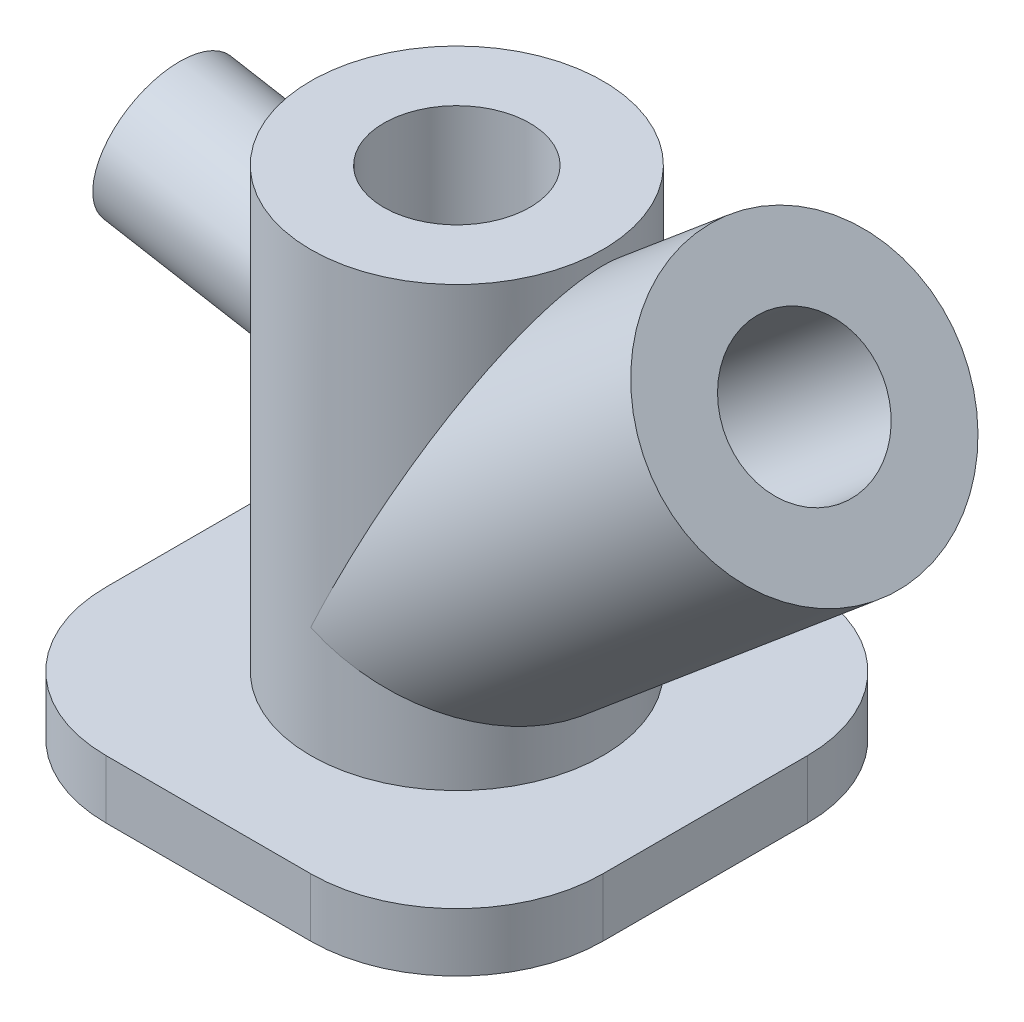
ISO-10303-21;
HEADER;
FILE_DESCRIPTION(('STEP AP214'),'2;1');
FILE_NAME('part.step','',(''),(''),'','','');
FILE_SCHEMA(('AUTOMOTIVE_DESIGN { 1 0 10303 214 1 1 1 1 }'));
ENDSEC;
DATA;
#1=APPLICATION_CONTEXT('core data for automotive mechanical design processes');
#2=APPLICATION_PROTOCOL_DEFINITION('international standard','automotive_design',2000,#1);
#3=PRODUCT_CONTEXT('',#1,'mechanical');
#4=PRODUCT('Part','Part','',(#3));
#5=PRODUCT_RELATED_PRODUCT_CATEGORY('part','',(#4));
#6=PRODUCT_DEFINITION_FORMATION('','',#4);
#7=PRODUCT_DEFINITION_CONTEXT('part definition',#1,'design');
#8=PRODUCT_DEFINITION('design','',#6,#7);
#9=PRODUCT_DEFINITION_SHAPE('','',#8);
#10=(LENGTH_UNIT() NAMED_UNIT(*) SI_UNIT(.MILLI.,.METRE.));
#11=(NAMED_UNIT(*) PLANE_ANGLE_UNIT() SI_UNIT($,.RADIAN.));
#12=(NAMED_UNIT(*) SI_UNIT($,.STERADIAN.) SOLID_ANGLE_UNIT());
#13=UNCERTAINTY_MEASURE_WITH_UNIT(LENGTH_MEASURE(1.E-05),#10,'distance_accuracy_value','');
#14=(GEOMETRIC_REPRESENTATION_CONTEXT(3) GLOBAL_UNCERTAINTY_ASSIGNED_CONTEXT((#13)) GLOBAL_UNIT_ASSIGNED_CONTEXT((#10,
#11,#12)) REPRESENTATION_CONTEXT('',''));
#15=CARTESIAN_POINT('',(0.,0.,0.));
#16=DIRECTION('',(0.,0.,1.));
#17=DIRECTION('',(1.,0.,0.));
#18=AXIS2_PLACEMENT_3D('',#15,#16,#17);
#19=CARTESIAN_POINT('',(0.,170.,0.));
#20=DIRECTION('',(0.,-1.,0.));
#21=DIRECTION('',(0.,0.,-1.));
#22=AXIS2_PLACEMENT_3D('',#19,#20,#21);
#23=CYLINDRICAL_SURFACE('',#22,50.);
#24=CARTESIAN_POINT('',(0.,58.0450184411362,0.));
#25=DIRECTION('',(0.4226182617407,0.90630778703665,0.));
#26=DIRECTION('',(0.906307787036649,-0.4226182617407,0.));
#27=AXIS2_PLACEMENT_3D('',#24,#25,#26);
#28=ELLIPSE('',#27,55.1688959481246,50.);
#29=CARTESIAN_POINT('',(0.,58.0450184411363,50.));
#30=VERTEX_POINT('',#29);
#31=CARTESIAN_POINT('',(0.,58.0450184411362,-50.));
#32=VERTEX_POINT('',#31);
#33=EDGE_CURVE('E138',#30,#32,#28,.T.);
#34=ORIENTED_EDGE('',*,*,#33,.F.);
#35=CARTESIAN_POINT('',(0.,58.0450184411362,0.));
#36=DIRECTION('',(0.906307787036649,-0.4226182617407,0.));
#37=DIRECTION('',(0.4226182617407,0.90630778703665,0.));
#38=AXIS2_PLACEMENT_3D('',#35,#36,#37);
#39=ELLIPSE('',#38,118.310079157625,50.);
#40=EDGE_CURVE('E66',#32,#30,#39,.T.);
#41=ORIENTED_EDGE('',*,*,#40,.F.);
#42=EDGE_LOOP('',(#34,#41));
#43=FACE_BOUND('',#42,.T.);
#44=CARTESIAN_POINT('',(0.,170.,0.));
#45=DIRECTION('',(0.,1.,0.));
#46=DIRECTION('',(0.,0.,1.));
#47=AXIS2_PLACEMENT_3D('',#44,#45,#46);
#48=CIRCLE('',#47,50.);
#49=CARTESIAN_POINT('',(0.,170.,50.));
#50=VERTEX_POINT('',#49);
#51=EDGE_CURVE('E148',#50,#50,#48,.T.);
#52=ORIENTED_EDGE('',*,*,#51,.F.);
#53=EDGE_LOOP('',(#52));
#54=FACE_BOUND('',#53,.T.);
#55=CARTESIAN_POINT('',(0.,20.,0.));
#56=DIRECTION('',(0.,1.,0.));
#57=DIRECTION('',(0.,0.,1.));
#58=AXIS2_PLACEMENT_3D('',#55,#56,#57);
#59=CIRCLE('',#58,50.);
#60=CARTESIAN_POINT('',(0.,20.,50.));
#61=VERTEX_POINT('',#60);
#62=EDGE_CURVE('E53',#61,#61,#59,.T.);
#63=ORIENTED_EDGE('',*,*,#62,.T.);
#64=EDGE_LOOP('',(#63));
#65=FACE_BOUND('',#64,.T.);
#66=CARTESIAN_POINT('',(-50.,94.6143347028564,0.));
#67=CARTESIAN_POINT('',(-49.9999974205173,94.6143370104762,0.683769614526524));
#68=CARTESIAN_POINT('',(-49.9859427588464,94.6403675697217,1.36758993254433));
#69=CARTESIAN_POINT('',(-49.9300637493252,94.7442856080541,2.73017085681891));
#70=CARTESIAN_POINT('',(-49.8882366224137,94.822178276743,3.40893094984836));
#71=CARTESIAN_POINT('',(-49.7778183945704,95.0292441660021,4.75669686962623));
#72=CARTESIAN_POINT('',(-49.7092148092875,95.1584413074419,5.42569799516341));
#73=CARTESIAN_POINT('',(-49.546919608656,95.4671224990813,6.74885663348031));
#74=CARTESIAN_POINT('',(-49.4532284701332,95.6466055935255,7.40301442812307));
#75=CARTESIAN_POINT('',(-49.2432278593259,96.0541614551474,8.69075795848963));
#76=CARTESIAN_POINT('',(-49.1269649270853,96.2821343337184,9.32438294567188));
#77=CARTESIAN_POINT('',(-48.8744476066246,96.7854075315033,10.5684082460756));
#78=CARTESIAN_POINT('',(-48.7381931369131,97.0607080436393,11.1788084646134));
#79=CARTESIAN_POINT('',(-48.4488595648421,97.657071754603,12.3727687048263));
#80=CARTESIAN_POINT('',(-48.2957780155802,97.9781416109803,12.9563248054284));
#81=CARTESIAN_POINT('',(-47.9763751175476,98.6643405241817,14.0931212353726));
#82=CARTESIAN_POINT('',(-47.8100534259139,99.0294707221063,14.6463607790188));
#83=CARTESIAN_POINT('',(-47.4624082629497,99.8148828506549,15.7371609255191));
#84=CARTESIAN_POINT('',(-47.2807703500464,100.236591089658,16.2735950247523));
#85=CARTESIAN_POINT('',(-46.9121760332906,101.12327596379,17.3074837492921));
#86=CARTESIAN_POINT('',(-46.72521949536,101.58825369038,17.8049373907448));
#87=CARTESIAN_POINT('',(-46.3508971465122,102.559568713954,18.7578375436637));
#88=CARTESIAN_POINT('',(-46.1635312394434,103.065917047869,19.2132727759241));
#89=CARTESIAN_POINT('',(-45.7936677202241,104.11761503323,20.0788836868117));
#90=CARTESIAN_POINT('',(-45.6111700862474,104.662964509778,20.4890595683796));
#91=CARTESIAN_POINT('',(-45.254683525863,105.795683739431,21.2649422351968));
#92=CARTESIAN_POINT('',(-45.0807976063329,106.383418315255,21.6301647416043));
#93=CARTESIAN_POINT('',(-44.7491355732758,107.592749774355,22.3082365146783));
#94=CARTESIAN_POINT('',(-44.5913596525385,108.214347062733,22.6210851546112));
#95=CARTESIAN_POINT('',(-44.2974983338386,109.4867496267,23.191259532847));
#96=CARTESIAN_POINT('',(-44.1613929028109,110.137527205017,23.4486366300341));
#97=CARTESIAN_POINT('',(-43.9156256881849,111.463838746237,23.9057591136535));
#98=CARTESIAN_POINT('',(-43.805960913154,112.139369898608,24.1055110201656));
#99=CARTESIAN_POINT('',(-43.6252945938812,113.449660711355,24.4308243693494));
#100=CARTESIAN_POINT('',(-43.5517576651517,114.082847581072,24.5613319565266));
#101=CARTESIAN_POINT('',(-43.4321635502894,115.360053053188,24.7722007574968));
#102=CARTESIAN_POINT('',(-43.3861046089863,116.004070961046,24.852565174225));
#103=CARTESIAN_POINT('',(-43.3225490654324,117.297721291582,24.9631891407469));
#104=CARTESIAN_POINT('',(-43.3050503381485,117.947353292926,24.9934524183365));
#105=CARTESIAN_POINT('',(-43.2985906455382,119.247157996945,25.0046412301015));
#106=CARTESIAN_POINT('',(-43.3096297605102,119.897330701137,24.9855666254522));
#107=CARTESIAN_POINT('',(-43.3580038594837,121.16213983119,24.9015188594484));
#108=CARTESIAN_POINT('',(-43.3940465118058,121.776979367414,24.8388009699454));
#109=CARTESIAN_POINT('',(-43.4894156314031,122.999033054608,24.6714404556483));
#110=CARTESIAN_POINT('',(-43.5487410998839,123.606247531528,24.5667996292749));
#111=CARTESIAN_POINT('',(-43.6885571195765,124.80997385746,24.3172857103871));
#112=CARTESIAN_POINT('',(-43.7690524287219,125.406483268266,24.1724035732042));
#113=CARTESIAN_POINT('',(-43.9487210064401,126.585941260491,23.8441792245356));
#114=CARTESIAN_POINT('',(-44.0478955749679,127.168888894924,23.6608343361912));
#115=CARTESIAN_POINT('',(-44.2742247437396,128.383141111034,23.2348340452958));
#116=CARTESIAN_POINT('',(-44.4032673899926,129.01257285307,22.9878410223019));
#117=CARTESIAN_POINT('',(-44.6773413453455,130.249081383441,22.4505254463652));
#118=CARTESIAN_POINT('',(-44.8223744792677,130.856155609786,22.1601979467844));
#119=CARTESIAN_POINT('',(-45.1247443633925,132.045995450437,21.5378090093763));
#120=CARTESIAN_POINT('',(-45.2820913542813,132.62874020039,21.2057126925898));
#121=CARTESIAN_POINT('',(-45.6052246231058,133.767111846372,20.5015503970951));
#122=CARTESIAN_POINT('',(-45.771011379658,134.322737200961,20.1294821502592));
#123=CARTESIAN_POINT('',(-46.133416664014,135.488471974528,19.2860027381762));
#124=CARTESIAN_POINT('',(-46.330831301436,136.093678737944,18.8081321953635));
#125=CARTESIAN_POINT('',(-46.7264162299674,137.261112698596,17.802640562321));
#126=CARTESIAN_POINT('',(-46.9245866297953,137.82333344692,17.2750120336388));
#127=CARTESIAN_POINT('',(-47.3160569814938,138.900309311597,16.1719772483777));
#128=CARTESIAN_POINT('',(-47.5093593139214,139.415087968771,15.5965949595944));
#129=CARTESIAN_POINT('',(-47.7914820898759,140.147997012276,14.6994077206121));
#130=CARTESIAN_POINT('',(-47.8842133784383,140.38574577822,14.3946760360086));
#131=CARTESIAN_POINT('',(-48.0664308108083,140.847640027826,13.7739923683567));
#132=CARTESIAN_POINT('',(-48.15591611277,141.071781992577,13.4580375160438));
#133=CARTESIAN_POINT('',(-48.3873437669983,141.645590870041,12.6081273764939));
#134=CARTESIAN_POINT('',(-48.525921944224,141.983048446905,12.0649191871289));
#135=CARTESIAN_POINT('',(-48.789282230443,142.615784704089,10.9514019016651));
#136=CARTESIAN_POINT('',(-48.9140668911132,142.911071188644,10.3810978460628));
#137=CARTESIAN_POINT('',(-49.1468690288969,143.456060360044,9.21616846202362));
#138=CARTESIAN_POINT('',(-49.2548965922981,143.705790483841,8.62155803836257));
#139=CARTESIAN_POINT('',(-49.4515239689308,144.156590753829,7.4109882344763));
#140=CARTESIAN_POINT('',(-49.540123565777,144.357660358049,6.79502861655599));
#141=CARTESIAN_POINT('',(-49.6959565722886,144.709220411247,5.54192453561224));
#142=CARTESIAN_POINT('',(-49.7630530183557,144.859386971255,4.9046717498291));
#143=CARTESIAN_POINT('',(-49.8731403270547,145.104865157284,3.61759177796644));
#144=CARTESIAN_POINT('',(-49.9161311202256,145.20017662524,2.96776455565899));
#145=CARTESIAN_POINT('',(-49.9766687089407,145.334192290471,1.66133280272256));
#146=CARTESIAN_POINT('',(-49.9942243693058,145.372916210055,1.00473071370772));
#147=CARTESIAN_POINT('',(-50.0033588952063,145.393080035525,-0.309503214050405));
#148=CARTESIAN_POINT('',(-49.9949399983561,145.374524875798,-0.967134959214428));
#149=CARTESIAN_POINT('',(-49.9546136155968,145.285384108985,-2.20954329617796));
#150=CARTESIAN_POINT('',(-49.925228449484,145.220384780121,-2.79481300750862));
#151=CARTESIAN_POINT('',(-49.8465610700055,145.045643014698,-3.95722491357461));
#152=CARTESIAN_POINT('',(-49.797280474891,144.935904217143,-4.53436776538092));
#153=CARTESIAN_POINT('',(-49.6800134980864,144.673218422081,-5.67680180250475));
#154=CARTESIAN_POINT('',(-49.6120257775175,144.5202683319,-6.24209213641366));
#155=CARTESIAN_POINT('',(-49.4589170743074,144.173149350376,-7.35747706474402));
#156=CARTESIAN_POINT('',(-49.3737953033583,143.978978562519,-7.90757095867877));
#157=CARTESIAN_POINT('',(-49.1860476217651,143.546575413149,-9.00270808762284));
#158=CARTESIAN_POINT('',(-49.0830508403701,143.307397930076,-9.5473137178049));
#159=CARTESIAN_POINT('',(-48.8632382420039,142.7908284834,-10.6151378938692));
#160=CARTESIAN_POINT('',(-48.746422374353,142.51343637965,-11.1383563613075));
#161=CARTESIAN_POINT('',(-48.5012932530952,141.923053175882,-12.1614677869305));
#162=CARTESIAN_POINT('',(-48.3729797160672,141.610061198264,-12.6613601696577));
#163=CARTESIAN_POINT('',(-48.1071945075437,140.950892991603,-13.6364720960583));
#164=CARTESIAN_POINT('',(-47.9697189170962,140.604702534182,-14.111680924998));
#165=CARTESIAN_POINT('',(-47.6674656612901,139.828731746769,-15.103621725449));
#166=CARTESIAN_POINT('',(-47.5016350555802,139.394130422369,-15.6162658548168));
#167=CARTESIAN_POINT('',(-47.1648021478064,138.487852960488,-16.6058642305704));
#168=CARTESIAN_POINT('',(-46.9937992280826,138.016172384293,-17.0828141906665));
#169=CARTESIAN_POINT('',(-46.6501084703486,137.038231904862,-18.0002094986339));
#170=CARTESIAN_POINT('',(-46.4774191597101,136.531938924525,-18.4406190116629));
#171=CARTESIAN_POINT('',(-46.1341862850847,135.487830816505,-19.2832532305185));
#172=CARTESIAN_POINT('',(-45.9636428306511,134.950014087294,-19.6854759935875));
#173=CARTESIAN_POINT('',(-45.6030902043994,133.761835979311,-20.5082719648703));
#174=CARTESIAN_POINT('',(-45.4140290541734,133.106741224471,-20.9224489244334));
#175=CARTESIAN_POINT('',(-45.0494075633064,131.761438851418,-21.6964041266871));
#176=CARTESIAN_POINT('',(-44.87384926778,131.071225940482,-22.0561741369552));
#177=CARTESIAN_POINT('',(-44.5422433084101,129.659783182607,-22.7183988750293));
#178=CARTESIAN_POINT('',(-44.3861842676647,128.938571755135,-23.0208870777112));
#179=CARTESIAN_POINT('',(-44.0994121945741,127.468904015715,-23.5655832613849));
#180=CARTESIAN_POINT('',(-43.9686932254875,126.72045413419,-23.8078053654622));
#181=CARTESIAN_POINT('',(-43.7586092198009,125.334976036799,-24.1913844010293));
#182=CARTESIAN_POINT('',(-43.6742547533378,124.701529817731,-24.3429913743364));
#183=CARTESIAN_POINT('',(-43.5295714578217,123.42274540625,-24.6007793643069));
#184=CARTESIAN_POINT('',(-43.4692399720008,122.777408537121,-24.7069654042936));
#185=CARTESIAN_POINT('',(-43.3751323895108,121.479306606256,-24.8718101861759));
#186=CARTESIAN_POINT('',(-43.3413329512454,120.826548587417,-24.9305107048989));
#187=CARTESIAN_POINT('',(-43.3019949799183,119.517564080235,-24.9987765429892));
#188=CARTESIAN_POINT('',(-43.2964566656612,118.861337565077,-25.0083414819365));
#189=CARTESIAN_POINT('',(-43.3145555423965,117.547754843513,-24.9769820089635));
#190=CARTESIAN_POINT('',(-43.3383129205827,116.890405105752,-24.9358496087393));
#191=CARTESIAN_POINT('',(-43.4149911804326,115.582663540902,-24.802105995321));
#192=CARTESIAN_POINT('',(-43.4679121714409,114.932271739909,-24.7094945891137));
#193=CARTESIAN_POINT('',(-43.601555716508,113.643685144109,-24.4728982124648));
#194=CARTESIAN_POINT('',(-43.6822836341373,113.005492727478,-24.3289033306702));
#195=CARTESIAN_POINT('',(-43.8690910382986,111.746478440287,-23.9904177849412));
#196=CARTESIAN_POINT('',(-43.9751698892431,111.125656134667,-23.7959283869721));
#197=CARTESIAN_POINT('',(-44.2019796536515,109.944247801879,-23.3717571303074));
#198=CARTESIAN_POINT('',(-44.3213701013204,109.382328604684,-23.1450565664034));
#199=CARTESIAN_POINT('',(-44.5762510456696,108.280862023389,-22.6502811266256));
#200=CARTESIAN_POINT('',(-44.7117407262301,107.74131350712,-22.382208347831));
#201=CARTESIAN_POINT('',(-44.9953333183317,106.687141844863,-21.8064877898426));
#202=CARTESIAN_POINT('',(-45.1434383272412,106.172522865947,-21.4988334256329));
#203=CARTESIAN_POINT('',(-45.4486080468436,105.17049327207,-20.8459553181402));
#204=CARTESIAN_POINT('',(-45.605673286572,104.683084267026,-20.500729355437));
#205=CARTESIAN_POINT('',(-45.9365882965493,103.703393226793,-19.7486823877968));
#206=CARTESIAN_POINT('',(-46.1108336526257,103.213272149116,-19.3392189269449));
#207=CARTESIAN_POINT('',(-46.4610515227661,102.268403031427,-18.482019485803));
#208=CARTESIAN_POINT('',(-46.6370241002332,101.813656295451,-18.034282095862));
#209=CARTESIAN_POINT('',(-46.9865783859314,100.941089521212,-17.1028927731438));
#210=CARTESIAN_POINT('',(-47.160158969307,100.523286387217,-16.6192245838815));
#211=CARTESIAN_POINT('',(-47.5008708650937,99.7264722458253,-15.6187876174266));
#212=CARTESIAN_POINT('',(-47.6680019855332,99.3474623925754,-15.1020178561648));
#213=CARTESIAN_POINT('',(-48.0048783460851,98.6014897131929,-13.9961242825764));
#214=CARTESIAN_POINT('',(-48.1737895859155,98.2378362932485,-13.4045086693855));
#215=CARTESIAN_POINT('',(-48.4954491781173,97.5594598804875,-12.1895976205771));
#216=CARTESIAN_POINT('',(-48.6481961653401,97.2447410193773,-11.5662995157914));
#217=CARTESIAN_POINT('',(-48.9335322539493,96.6663277859427,-10.2924808452216));
#218=CARTESIAN_POINT('',(-49.0661334190304,96.4026028514914,-9.64197687084273));
#219=CARTESIAN_POINT('',(-49.3078652959244,95.9277496283476,-8.31787771932576));
#220=CARTESIAN_POINT('',(-49.416999774508,95.716612897562,-7.64428626824432));
#221=CARTESIAN_POINT('',(-49.5921959555502,95.3806680120862,-6.39827713506202));
#222=CARTESIAN_POINT('',(-49.6624522787228,95.2472206392518,-5.82875883706694));
#223=CARTESIAN_POINT('',(-49.7838193041874,95.0179054892632,-4.68024055814992));
#224=CARTESIAN_POINT('',(-49.834932478786,94.9220328593171,-4.10124181170039));
#225=CARTESIAN_POINT('',(-49.9170855971667,94.7684176468658,-2.9368609000949));
#226=CARTESIAN_POINT('',(-49.948127868492,94.7106706430659,-2.35147948312086));
#227=CARTESIAN_POINT('',(-49.9895873771418,94.6336259466117,-1.17741149031597));
#228=CARTESIAN_POINT('',(-50.0000022209306,94.6143327159995,-0.588724538869235));
#229=CARTESIAN_POINT('',(-50.,94.6143347028564,0.));
#230=B_SPLINE_CURVE_WITH_KNOTS('',3,(#66,#67,#68,#69,#70,#71,#72,#73,#74,#75,#76,#77,#78,#79,
#80,#81,#82,#83,#84,#85,#86,#87,#88,#89,#90,#91,#92,#93,#94,#95,#96,#97,#98,#99,#100,#101,#102,
#103,#104,#105,#106,#107,#108,#109,#110,#111,#112,#113,#114,#115,#116,#117,#118,#119,#120,#121,
#122,#123,#124,#125,#126,#127,#128,#129,#130,#131,#132,#133,#134,#135,#136,#137,#138,#139,#140,
#141,#142,#143,#144,#145,#146,#147,#148,#149,#150,#151,#152,#153,#154,#155,#156,#157,#158,#159,
#160,#161,#162,#163,#164,#165,#166,#167,#168,#169,#170,#171,#172,#173,#174,#175,#176,#177,#178,
#179,#180,#181,#182,#183,#184,#185,#186,#187,#188,#189,#190,#191,#192,#193,#194,#195,#196,#197,
#198,#199,#200,#201,#202,#203,#204,#205,#206,#207,#208,#209,#210,#211,#212,#213,#214,#215,#216,
#217,#218,#219,#220,#221,#222,#223,#224,#225,#226,#227,#228,#229),.UNSPECIFIED.,.T.,.F.,(4,2,2,
2,2,2,2,2,2,2,2,2,2,2,2,2,2,2,2,2,2,2,2,2,2,2,2,2,2,2,2,2,2,2,2,2,2,2,2,2,2,2,2,2,2,2,2,2,2,2,2,
2,2,2,2,2,2,2,2,2,2,2,2,2,2,2,2,2,2,2,2,2,2,2,2,2,2,2,2,2,2,4),(0.,2.05076013159097,
4.10172550413175,6.15364827054518,8.20553203991569,10.2532291868808,12.3009346810888,
14.3489383363928,16.3969950434805,18.5128970719049,20.6288524878101,22.7453742572862,
24.8618865360079,26.9995064762076,29.1371519944822,31.272809768231,33.4082258052506,
35.3576712280476,37.3069921157011,39.2561679568016,41.205349282407,43.0606353326241,
44.9158418028377,46.7714655886029,48.6272185614731,50.6902803808798,52.7535778795127,
54.8186099140159,56.8837591866091,59.2689853125421,61.6545685791736,64.0389616704254,
65.2310369887575,66.4234192926853,68.3843359167991,70.3448891796897,72.3042577454641,
74.2636481332332,76.2352815727801,78.2069206936041,80.1778724802579,82.1486544812603,
83.9153773215238,85.6819564893157,87.4486621250128,89.2154490623708,91.0246127572298,
92.8337830871594,94.6429980259857,96.4529918629185,98.5276291462612,100.602515161404,
102.679412519159,104.756415482862,107.146967021513,109.537879918081,111.92739124953,
114.316342081345,116.284708336068,118.252856843218,120.219271923095,122.185702227431,
124.160226829103,126.134758834017,128.109671912249,130.084535481535,131.935239417466,
133.785849575514,135.636768010589,137.487795842066,139.471674324255,141.455625905348,
143.440480634823,145.425394399016,147.566903489224,149.708593296042,151.848995520784,
153.98905392055,155.754983190647,157.520684315116,159.286180641458,161.051881817926),.UNSPECIFIED.);
#231=CARTESIAN_POINT('',(-50.,94.6143347028564,0.));
#232=VERTEX_POINT('',#231);
#233=EDGE_CURVE('E11',#232,#232,#230,.T.);
#234=ORIENTED_EDGE('',*,*,#233,.F.);
#235=EDGE_LOOP('',(#234));
#236=FACE_BOUND('',#235,.T.);
#237=ADVANCED_FACE('F39',(#43,#54,#65,#236),#23,.T.);
#238=CARTESIAN_POINT('',(0.,0.,0.));
#239=DIRECTION('',(0.,1.,0.));
#240=DIRECTION('',(0.,0.,1.));
#241=AXIS2_PLACEMENT_3D('',#238,#239,#240);
#242=CYLINDRICAL_SURFACE('',#241,25.);
#243=CARTESIAN_POINT('',(-25.,102.898992833717,0.));
#244=CARTESIAN_POINT('',(-24.9999987078731,102.898993989917,-0.341884780672688));
#245=CARTESIAN_POINT('',(-24.9929713787839,102.91200926779,-0.68379495914682));
#246=CARTESIAN_POINT('',(-24.9650318753019,102.963968285675,-1.36508543553551));
#247=CARTESIAN_POINT('',(-24.9441183113782,103.002914620488,-1.70446547683394));
#248=CARTESIAN_POINT('',(-24.8889091971137,103.106447565461,-2.37834843290246));
#249=CARTESIAN_POINT('',(-24.8546074045977,103.171046136056,-2.71284899707001));
#250=CARTESIAN_POINT('',(-24.773459804374,103.325386731783,-3.37442831725183));
#251=CARTESIAN_POINT('',(-24.7266142350793,103.415128279038,-3.70150721419765));
#252=CARTESIAN_POINT('',(-24.6216139296503,103.618906209876,-4.34537897910897));
#253=CARTESIAN_POINT('',(-24.5634824635378,103.732892649155,-4.66219147280273));
#254=CARTESIAN_POINT('',(-24.4372238033172,103.984529248032,-5.28420412307102));
#255=CARTESIAN_POINT('',(-24.3690965684633,104.122179504091,-5.5894042323037));
#256=CARTESIAN_POINT('',(-24.2244297824143,104.420361359607,-6.18638435241616));
#257=CARTESIAN_POINT('',(-24.1478890077678,104.580896287841,-6.47816240275947));
#258=CARTESIAN_POINT('',(-23.9881875587961,104.923995744317,-7.04656061764104));
#259=CARTESIAN_POINT('',(-23.9050267130395,105.106560843111,-7.32318038933145));
#260=CARTESIAN_POINT('',(-23.7312041313896,105.499266907854,-7.8685804629434));
#261=CARTESIAN_POINT('',(-23.6403851747004,105.71012102802,-8.13679751307547));
#262=CARTESIAN_POINT('',(-23.456088016968,106.153463463281,-8.65374187394668));
#263=CARTESIAN_POINT('',(-23.3626097488858,106.385952324107,-8.90246869275881));
#264=CARTESIAN_POINT('',(-23.1754461925107,106.871616017215,-9.37892483196162));
#265=CARTESIAN_POINT('',(-23.0817608515723,107.124796892371,-9.60664797683659));
#266=CARTESIAN_POINT('',(-22.8968292163988,107.65064687534,-10.0394522817675));
#267=CARTESIAN_POINT('',(-22.8055827874963,107.923314904079,-10.2445346939236));
#268=CARTESIAN_POINT('',(-22.6273417640001,108.489667348859,-10.6324711148423));
#269=CARTESIAN_POINT('',(-22.5403988034535,108.783534639076,-10.8150823700621));
#270=CARTESIAN_POINT('',(-22.3745677863508,109.388200370306,-11.1541182580792));
#271=CARTESIAN_POINT('',(-22.2956798261897,109.69899901387,-11.3105425775097));
#272=CARTESIAN_POINT('',(-22.1487491669989,110.335200295424,-11.5956297662196));
#273=CARTESIAN_POINT('',(-22.0806964514369,110.660589084777,-11.7243183149406));
#274=CARTESIAN_POINT('',(-21.957812844061,111.323744855427,-11.9528795569032));
#275=CARTESIAN_POINT('',(-21.9029804565306,111.661510431459,-12.0527555101848));
#276=CARTESIAN_POINT('',(-21.8126472969829,112.316655838088,-12.2154121845816));
#277=CARTESIAN_POINT('',(-21.7758788327116,112.63324927331,-12.2806659779708));
#278=CARTESIAN_POINT('',(-21.7160817750089,113.271852008397,-12.3861003790408));
#279=CARTESIAN_POINT('',(-21.6930523039924,113.593860960993,-12.4262825881892));
#280=CARTESIAN_POINT('',(-21.6612745332169,114.240686129897,-12.4815945692968));
#281=CARTESIAN_POINT('',(-21.6525251709411,114.565502135537,-12.4967262051543));
#282=CARTESIAN_POINT('',(-21.6492953209022,115.215404473975,-12.5023206190647));
#283=CARTESIAN_POINT('',(-21.6548148732884,115.540490807531,-12.4927833277054));
#284=CARTESIAN_POINT('',(-21.679001936373,116.17289542199,-12.4507594154665));
#285=CARTESIAN_POINT('',(-21.6970232800973,116.48031525395,-12.4194004329521));
#286=CARTESIAN_POINT('',(-21.7447077915082,117.091341921641,-12.3357202798425));
#287=CARTESIAN_POINT('',(-21.7743704598013,117.39494892036,-12.2834000084499));
#288=CARTESIAN_POINT('',(-21.8442734548175,117.996768012097,-12.1586519325094));
#289=CARTESIAN_POINT('',(-21.8845145884319,118.294979691723,-12.0862225940828));
#290=CARTESIAN_POINT('',(-21.974345410783,118.88470814325,-11.9221176144575));
#291=CARTESIAN_POINT('',(-22.0239385240879,119.176222418645,-11.8304349215392));
#292=CARTESIAN_POINT('',(-22.1371158160137,119.783412084703,-11.6174101868372));
#293=CARTESIAN_POINT('',(-22.2016436890886,120.098153845926,-11.4939001804632));
#294=CARTESIAN_POINT('',(-22.3386698822162,120.716365759371,-11.2252650104671));
#295=CARTESIAN_POINT('',(-22.4111685776587,121.019835379825,-11.080138828707));
#296=CARTESIAN_POINT('',(-22.6379469985249,121.912202637794,-10.6133407242888));
#297=CARTESIAN_POINT('',(-22.8014753271804,122.48288713688,-10.2603099188372));
#298=CARTESIAN_POINT('',(-23.0667411804345,123.336172792198,-9.64292921896681));
#299=CARTESIAN_POINT('',(-23.1654233781094,123.638691804564,-9.40405055961886));
#300=CARTESIAN_POINT('',(-23.363200386442,124.222354874267,-8.9013358215329));
#301=CARTESIAN_POINT('',(-23.4622952566679,124.503495724342,-8.63749601126818));
#302=CARTESIAN_POINT('',(-23.6580272236592,125.041978470766,-8.08599673117676));
#303=CARTESIAN_POINT('',(-23.7546655057464,125.29933200899,-7.79834904535269));
#304=CARTESIAN_POINT('',(-23.9427632091917,125.787980611076,-7.20016068125617));
#305=CARTESIAN_POINT('',(-24.0342238750241,126.019281950097,-6.88962554579496));
#306=CARTESIAN_POINT('',(-24.1936964826166,126.414680796546,-6.30397787106927));
#307=CARTESIAN_POINT('',(-24.262991264417,126.583423299866,-6.03234272662709));
#308=CARTESIAN_POINT('',(-24.3946631573952,126.899769976223,-5.4755965429058));
#309=CARTESIAN_POINT('',(-24.457044273052,127.047386400329,-5.19049344237226));
#310=CARTESIAN_POINT('',(-24.5734352473593,127.319857401462,-4.60808186349181));
#311=CARTESIAN_POINT('',(-24.6274484925572,127.444721190296,-4.31077838468332));
#312=CARTESIAN_POINT('',(-24.7257617880497,127.670120393098,-3.70549475177612));
#313=CARTESIAN_POINT('',(-24.7700617301588,127.770655536097,-3.39751447880482));
#314=CARTESIAN_POINT('',(-24.8479783392047,127.946435813913,-2.77096209620406));
#315=CARTESIAN_POINT('',(-24.8815265232018,128.021519001541,-2.45233582887356));
#316=CARTESIAN_POINT('',(-24.9365701495109,128.144258027322,-1.80879593493633));
#317=CARTESIAN_POINT('',(-24.9580655570933,128.191913786444,-1.48388229021565));
#318=CARTESIAN_POINT('',(-24.9883343590674,128.258921637131,-0.830666389169722));
#319=CARTESIAN_POINT('',(-24.9971121858746,128.278283589862,-0.502365353636712));
#320=CARTESIAN_POINT('',(-25.0016794463809,128.288365497504,0.154751603719161));
#321=CARTESIAN_POINT('',(-24.997469998886,128.279087919605,0.483567478751453));
#322=CARTESIAN_POINT('',(-24.9773068080605,128.234517537304,1.10477164884586));
#323=CARTESIAN_POINT('',(-24.9626142247538,128.202017872284,1.39740650398674));
#324=CARTESIAN_POINT('',(-24.9232805349892,128.114646989699,1.97861245658125));
#325=CARTESIAN_POINT('',(-24.8986402376572,128.059777591637,2.26718388257052));
#326=CARTESIAN_POINT('',(-24.8400067488312,127.928434692551,2.83840090137575));
#327=CARTESIAN_POINT('',(-24.8060128878975,127.851959645188,3.12104606848734));
#328=CARTESIAN_POINT('',(-24.7294585380165,127.67840016053,3.67873853207974));
#329=CARTESIAN_POINT('',(-24.6868976549151,127.581314774977,3.95378547831698));
#330=CARTESIAN_POINT('',(-24.5930322127841,127.365132535278,4.50130501702212));
#331=CARTESIAN_POINT('',(-24.5415436356594,127.245566731861,4.77356047978368));
#332=CARTESIAN_POINT('',(-24.4316398362581,126.987288928137,5.30747620540855));
#333=CARTESIAN_POINT('',(-24.3732221429609,126.848570094677,5.56913264361588));
#334=CARTESIAN_POINT('',(-24.2506442618859,126.553346339029,6.08074357319511));
#335=CARTESIAN_POINT('',(-24.1864847382222,126.396843473221,6.33069941280637));
#336=CARTESIAN_POINT('',(-24.0535925907146,126.067260323964,6.81825261088405));
#337=CARTESIAN_POINT('',(-23.9848583428164,125.894174143652,7.05584552652775));
#338=CARTESIAN_POINT('',(-23.8337293515967,125.506182127444,7.55182067279458));
#339=CARTESIAN_POINT('',(-23.7508071147978,125.288862581713,7.80815999364808));
#340=CARTESIAN_POINT('',(-23.5824040144683,124.83575996907,8.30292700276595));
#341=CARTESIAN_POINT('',(-23.4969229581163,124.59997550855,8.54135333641112));
#342=CARTESIAN_POINT('',(-23.2391453779905,123.86650085381,9.22939954388855));
#343=CARTESIAN_POINT('',(-23.0655775303124,123.342846589743,9.65158746960531));
#344=CARTESIAN_POINT('',(-22.801512850297,122.472636527669,10.2542185756641));
#345=CARTESIAN_POINT('',(-22.7070058850629,122.145167438273,10.4612465934045));
#346=CARTESIAN_POINT('',(-22.5247124249834,121.47257356858,10.8481799288104));
#347=CARTESIAN_POINT('',(-22.4369269481698,121.127446126916,11.0280811418537));
#348=CARTESIAN_POINT('',(-22.271119341282,120.421709403705,11.3592053606643));
#349=CARTESIAN_POINT('',(-22.1930915180513,120.061109316289,11.5104451159198));
#350=CARTESIAN_POINT('',(-22.0497067129237,119.326279533234,11.7827900539981));
#351=CARTESIAN_POINT('',(-21.9843467631635,118.952053054488,11.9039022970646));
#352=CARTESIAN_POINT('',(-21.8793027292222,118.259301499037,12.0956957258072));
#353=CARTESIAN_POINT('',(-21.8371242195705,117.942566808743,12.1715013886764));
#354=CARTESIAN_POINT('',(-21.7647835249625,117.303174384415,12.3003935329312));
#355=CARTESIAN_POINT('',(-21.7346191225283,116.980517754921,12.3534842070209));
#356=CARTESIAN_POINT('',(-21.6875661867869,116.331478760788,12.4359051146777));
#357=CARTESIAN_POINT('',(-21.6706664734772,116.005099769431,12.4652553582531));
#358=CARTESIAN_POINT('',(-21.6509974921047,115.350607528973,12.4993882656909));
#359=CARTESIAN_POINT('',(-21.6482283334441,115.022494266465,12.5041707393436));
#360=CARTESIAN_POINT('',(-21.6572777705822,114.365702902401,12.4884910061131));
#361=CARTESIAN_POINT('',(-21.6691564599853,114.037028035194,12.4679248050571));
#362=CARTESIAN_POINT('',(-21.7074955905223,113.38315725271,12.401052996973));
#363=CARTESIAN_POINT('',(-21.7339560863285,113.057961350483,12.3547472934384));
#364=CARTESIAN_POINT('',(-21.8007778576459,112.413668056104,12.2364491073511));
#365=CARTESIAN_POINT('',(-21.841141814942,112.094571853043,12.1644516691227));
#366=CARTESIAN_POINT('',(-21.9345455212759,111.465064695417,11.9952088886831));
#367=CARTESIAN_POINT('',(-21.9875849525198,111.154653523324,11.8979641794549));
#368=CARTESIAN_POINT('',(-22.1009789193781,110.564006184114,11.685898963167));
#369=CARTESIAN_POINT('',(-22.1606613034794,110.283101516582,11.5725733713944));
#370=CARTESIAN_POINT('',(-22.2880985869225,109.732363790363,11.3251938607559));
#371=CARTESIAN_POINT('',(-22.3558562783456,109.462534604688,11.1911327676792));
#372=CARTESIAN_POINT('',(-22.4976526628838,108.935448418895,10.9032723084249));
#373=CARTESIAN_POINT('',(-22.5716899110534,108.678188547897,10.7494774788868));
#374=CARTESIAN_POINT('',(-22.7242729979094,108.177168409085,10.4230458509743));
#375=CARTESIAN_POINT('',(-22.8028208680494,107.933414322541,10.2504005308294));
#376=CARTESIAN_POINT('',(-22.9683105235661,107.443473612213,9.87430397695257));
#377=CARTESIAN_POINT('',(-23.0554501609116,107.198367791211,9.66953111964528));
#378=CARTESIAN_POINT('',(-23.2305594240821,106.725940010437,9.24092410246035));
#379=CARTESIAN_POINT('',(-23.3185287528315,106.498611937326,9.01709655082477));
#380=CARTESIAN_POINT('',(-23.4933042925532,106.062332549822,8.551406146262));
#381=CARTESIAN_POINT('',(-23.5801094914226,105.853396445693,8.30952866575843));
#382=CARTESIAN_POINT('',(-23.7504643347497,105.454996067141,7.80930445859317));
#383=CARTESIAN_POINT('',(-23.8340149984775,105.265525665419,7.55096295612291));
#384=CARTESIAN_POINT('',(-24.002439164737,104.892570356385,6.99806216227763));
#385=CARTESIAN_POINT('',(-24.0868947907043,104.71074363369,6.70225434079635));
#386=CARTESIAN_POINT('',(-24.2477245913123,104.371555417755,6.09479880418442));
#387=CARTESIAN_POINT('',(-24.3240980833782,104.21419599037,5.78314975447117));
#388=CARTESIAN_POINT('',(-24.4667661262669,103.924989376866,5.14624042603331));
#389=CARTESIAN_POINT('',(-24.5330667089362,103.793126909686,4.82098844301047));
#390=CARTESIAN_POINT('',(-24.6539326485411,103.555700294811,4.15893885207499));
#391=CARTESIAN_POINT('',(-24.7084998888619,103.450131926071,3.82214310719444));
#392=CARTESIAN_POINT('',(-24.7960902313564,103.282174343944,3.19919367345616));
#393=CARTESIAN_POINT('',(-24.8312123951157,103.215461913732,2.91449087176902));
#394=CARTESIAN_POINT('',(-24.8918996422501,103.100796996546,2.3402336036538));
#395=CARTESIAN_POINT('',(-24.9174622194005,103.052849428979,2.0506778857021));
#396=CARTESIAN_POINT('',(-24.9585469533875,102.97602653661,1.4683715594701));
#397=CARTESIAN_POINT('',(-24.9740702083593,102.947149125842,1.17562130418251));
#398=CARTESIAN_POINT('',(-24.9947958008972,102.908634548662,0.588586661639356));
#399=CARTESIAN_POINT('',(-25.0000011122943,102.898991838432,0.294302740940623));
#400=CARTESIAN_POINT('',(-25.,102.898992833717,0.));
#401=B_SPLINE_CURVE_WITH_KNOTS('',3,(#243,#244,#245,#246,#247,#248,#249,#250,#251,#252,#253,
#254,#255,#256,#257,#258,#259,#260,#261,#262,#263,#264,#265,#266,#267,#268,#269,#270,#271,#272,
#273,#274,#275,#276,#277,#278,#279,#280,#281,#282,#283,#284,#285,#286,#287,#288,#289,#290,#291,
#292,#293,#294,#295,#296,#297,#298,#299,#300,#301,#302,#303,#304,#305,#306,#307,#308,#309,#310,
#311,#312,#313,#314,#315,#316,#317,#318,#319,#320,#321,#322,#323,#324,#325,#326,#327,#328,#329,
#330,#331,#332,#333,#334,#335,#336,#337,#338,#339,#340,#341,#342,#343,#344,#345,#346,#347,#348,
#349,#350,#351,#352,#353,#354,#355,#356,#357,#358,#359,#360,#361,#362,#363,#364,#365,#366,#367,
#368,#369,#370,#371,#372,#373,#374,#375,#376,#377,#378,#379,#380,#381,#382,#383,#384,#385,#386,
#387,#388,#389,#390,#391,#392,#393,#394,#395,#396,#397,#398,#399,#400),.UNSPECIFIED.,.T.,.F.,(4,
2,2,2,2,2,2,2,2,2,2,2,2,2,2,2,2,2,2,2,2,2,2,2,2,2,2,2,2,2,2,2,2,2,2,2,2,2,2,2,2,2,2,2,2,2,2,2,2,
2,2,2,2,2,2,2,2,2,2,2,2,2,2,2,2,2,2,2,2,2,2,2,2,2,2,2,2,2,4),(0.,1.02538006579548,
2.05086275206587,3.07682413527259,4.10276601995784,5.12661459344038,6.15046734054439,
7.17446916819641,8.19849752174026,9.25644853595244,10.314426243905,11.3727140341858,
12.4309432686435,13.4997532387433,14.5685759978806,15.6364048847551,16.7041129032648,
17.6788356146633,18.65349605849,19.6280839790403,20.602674641843,21.5303176669516,
22.4579209020583,23.3855949122996,24.3136092861889,25.3451748137104,26.3767889441167,
28.4405673224124,29.6331803853963,30.8259720187059,32.0181767557327,33.2100937110752,
34.1907466911571,35.170828663474,36.1505129463346,37.1302081402458,38.1160248600766,
39.1018444204713,40.087320313782,41.0727113143398,41.9560727344917,42.8393623183675,
43.7227151362068,44.606108604895,45.5105303617697,46.4152756234407,47.3199163749833,
48.224880010274,49.262221650925,50.2996416588204,52.375258866824,53.5705346361499,
54.7659910844339,55.9607467501582,57.1552221660657,58.1394417295915,59.1234795486438,
60.1066870885826,61.0899022407508,62.0771645415864,63.0644305440434,64.0518870831596,
65.0393188678026,65.9644869862434,66.8899759196906,67.8152524700317,68.7409490571442,
69.7330779131477,70.7248640858548,71.7174629131064,72.7097483325191,73.7805028776231,
74.8513477810324,75.9215488934035,76.9915780932862,77.8743700520007,78.7573932891777,
79.6403199219289,80.5229920411023),.UNSPECIFIED.);
#402=CARTESIAN_POINT('',(-25.,102.898992833717,0.));
#403=VERTEX_POINT('',#402);
#404=EDGE_CURVE('E131',#403,#403,#401,.T.);
#405=ORIENTED_EDGE('',*,*,#404,.F.);
#406=EDGE_LOOP('',(#405));
#407=FACE_BOUND('',#406,.T.);
#408=CARTESIAN_POINT('',(0.,170.,0.));
#409=DIRECTION('',(0.,1.,0.));
#410=DIRECTION('',(0.,0.,1.));
#411=AXIS2_PLACEMENT_3D('',#408,#409,#410);
#412=CIRCLE('',#411,25.);
#413=CARTESIAN_POINT('',(0.,170.,25.));
#414=VERTEX_POINT('',#413);
#415=EDGE_CURVE('E143',#414,#414,#412,.T.);
#416=ORIENTED_EDGE('',*,*,#415,.T.);
#417=EDGE_LOOP('',(#416));
#418=FACE_BOUND('',#417,.T.);
#419=CARTESIAN_POINT('',(0.,0.,0.));
#420=DIRECTION('',(0.,1.,0.));
#421=DIRECTION('',(0.,0.,1.));
#422=AXIS2_PLACEMENT_3D('',#419,#420,#421);
#423=CIRCLE('',#422,25.);
#424=CARTESIAN_POINT('',(0.,0.,25.));
#425=VERTEX_POINT('',#424);
#426=EDGE_CURVE('E144',#425,#425,#423,.T.);
#427=ORIENTED_EDGE('',*,*,#426,.F.);
#428=EDGE_LOOP('',(#427));
#429=FACE_BOUND('',#428,.T.);
#430=CARTESIAN_POINT('',(0.,58.0450184411362,0.));
#431=DIRECTION('',(0.906307787036649,-0.4226182617407,0.));
#432=DIRECTION('',(0.4226182617407,0.90630778703665,0.));
#433=AXIS2_PLACEMENT_3D('',#430,#431,#432);
#434=ELLIPSE('',#433,59.1550395788123,25.);
#435=CARTESIAN_POINT('',(0.,58.0450184411362,25.));
#436=VERTEX_POINT('',#435);
#437=CARTESIAN_POINT('',(0.,58.0450184411363,-25.));
#438=VERTEX_POINT('',#437);
#439=EDGE_CURVE('E59',#436,#438,#434,.F.);
#440=ORIENTED_EDGE('',*,*,#439,.F.);
#441=CARTESIAN_POINT('',(0.,58.0450184411362,0.));
#442=DIRECTION('',(0.4226182617407,0.90630778703665,0.));
#443=DIRECTION('',(0.906307787036649,-0.4226182617407,0.));
#444=AXIS2_PLACEMENT_3D('',#441,#442,#443);
#445=ELLIPSE('',#444,27.5844479740623,25.);
#446=EDGE_CURVE('E119',#438,#436,#445,.F.);
#447=ORIENTED_EDGE('',*,*,#446,.F.);
#448=EDGE_LOOP('',(#440,#447));
#449=FACE_BOUND('',#448,.T.);
#450=ADVANCED_FACE('F125',(#407,#418,#429,#449),#242,.F.);
#451=CARTESIAN_POINT('',(-35.,20.,-35.));
#452=DIRECTION('',(0.,-1.,0.));
#453=DIRECTION('',(0.,0.,-1.));
#454=AXIS2_PLACEMENT_3D('',#451,#452,#453);
#455=CYLINDRICAL_SURFACE('',#454,50.);
#456=CARTESIAN_POINT('',(-35.,0.,-35.));
#457=DIRECTION('',(0.,1.,0.));
#458=DIRECTION('',(0.,0.,-1.));
#459=AXIS2_PLACEMENT_3D('',#456,#457,#458);
#460=CIRCLE('',#459,50.);
#461=CARTESIAN_POINT('',(-34.9999999999996,0.,-85.));
#462=VERTEX_POINT('',#461);
#463=CARTESIAN_POINT('',(-85.,0.,-34.9999999999996));
#464=VERTEX_POINT('',#463);
#465=EDGE_CURVE('E155',#462,#464,#460,.T.);
#466=ORIENTED_EDGE('',*,*,#465,.T.);
#467=DIRECTION('',(0.,-1.,0.));
#468=VECTOR('',#467,1.);
#469=CARTESIAN_POINT('',(-85.,20.,-34.9999999999996));
#470=LINE('',#469,#468);
#471=CARTESIAN_POINT('',(-85.,20.,-34.9999999999996));
#472=VERTEX_POINT('',#471);
#473=EDGE_CURVE('E159',#472,#464,#470,.T.);
#474=ORIENTED_EDGE('',*,*,#473,.F.);
#475=CARTESIAN_POINT('',(-35.,20.,-35.));
#476=DIRECTION('',(0.,1.,0.));
#477=DIRECTION('',(0.,0.,-1.));
#478=AXIS2_PLACEMENT_3D('',#475,#476,#477);
#479=CIRCLE('',#478,50.);
#480=CARTESIAN_POINT('',(-34.9999999999996,20.,-85.));
#481=VERTEX_POINT('',#480);
#482=EDGE_CURVE('E160',#481,#472,#479,.T.);
#483=ORIENTED_EDGE('',*,*,#482,.F.);
#484=DIRECTION('',(0.,-1.,0.));
#485=VECTOR('',#484,1.);
#486=CARTESIAN_POINT('',(-34.9999999999996,20.,-85.));
#487=LINE('',#486,#485);
#488=EDGE_CURVE('E186',#481,#462,#487,.T.);
#489=ORIENTED_EDGE('',*,*,#488,.T.);
#490=EDGE_LOOP('',(#466,#474,#483,#489));
#491=FACE_BOUND('',#490,.T.);
#492=ADVANCED_FACE('F41',(#491),#455,.T.);
#493=CARTESIAN_POINT('',(-85.,20.,34.9999999999997));
#494=DIRECTION('',(1.,0.,0.));
#495=DIRECTION('',(0.,0.,-1.));
#496=AXIS2_PLACEMENT_3D('',#493,#494,#495);
#497=PLANE('',#496);
#498=DIRECTION('',(0.,0.,1.));
#499=VECTOR('',#498,1.);
#500=CARTESIAN_POINT('',(-85.,0.,34.9999999999997));
#501=LINE('',#500,#499);
#502=CARTESIAN_POINT('',(-85.,0.,34.9999999999997));
#503=VERTEX_POINT('',#502);
#504=EDGE_CURVE('E190',#464,#503,#501,.T.);
#505=ORIENTED_EDGE('',*,*,#504,.T.);
#506=DIRECTION('',(0.,-1.,0.));
#507=VECTOR('',#506,1.);
#508=CARTESIAN_POINT('',(-85.,20.,34.9999999999997));
#509=LINE('',#508,#507);
#510=CARTESIAN_POINT('',(-85.,20.,34.9999999999997));
#511=VERTEX_POINT('',#510);
#512=EDGE_CURVE('E233',#511,#503,#509,.T.);
#513=ORIENTED_EDGE('',*,*,#512,.F.);
#514=DIRECTION('',(0.,0.,1.));
#515=VECTOR('',#514,1.);
#516=CARTESIAN_POINT('',(-85.,20.,34.9999999999997));
#517=LINE('',#516,#515);
#518=EDGE_CURVE('E164',#472,#511,#517,.T.);
#519=ORIENTED_EDGE('',*,*,#518,.F.);
#520=ORIENTED_EDGE('',*,*,#473,.T.);
#521=EDGE_LOOP('',(#505,#513,#519,#520));
#522=FACE_BOUND('',#521,.T.);
#523=ADVANCED_FACE('F306',(#522),#497,.F.);
#524=CARTESIAN_POINT('',(-35.,20.,35.));
#525=DIRECTION('',(0.,-1.,0.));
#526=DIRECTION('',(0.,0.,-1.));
#527=AXIS2_PLACEMENT_3D('',#524,#525,#526);
#528=CYLINDRICAL_SURFACE('',#527,50.);
#529=CARTESIAN_POINT('',(-35.,0.,35.));
#530=DIRECTION('',(0.,1.,0.));
#531=DIRECTION('',(0.,0.,-1.));
#532=AXIS2_PLACEMENT_3D('',#529,#530,#531);
#533=CIRCLE('',#532,50.);
#534=CARTESIAN_POINT('',(-34.9999999999996,0.,85.));
#535=VERTEX_POINT('',#534);
#536=EDGE_CURVE('E193',#503,#535,#533,.T.);
#537=ORIENTED_EDGE('',*,*,#536,.T.);
#538=DIRECTION('',(0.,-1.,0.));
#539=VECTOR('',#538,1.);
#540=CARTESIAN_POINT('',(-34.9999999999996,20.,85.));
#541=LINE('',#540,#539);
#542=CARTESIAN_POINT('',(-34.9999999999996,20.,85.));
#543=VERTEX_POINT('',#542);
#544=EDGE_CURVE('E229',#543,#535,#541,.T.);
#545=ORIENTED_EDGE('',*,*,#544,.F.);
#546=CARTESIAN_POINT('',(-35.,20.,35.));
#547=DIRECTION('',(0.,1.,0.));
#548=DIRECTION('',(0.,0.,-1.));
#549=AXIS2_PLACEMENT_3D('',#546,#547,#548);
#550=CIRCLE('',#549,50.);
#551=EDGE_CURVE('E168',#511,#543,#550,.T.);
#552=ORIENTED_EDGE('',*,*,#551,.F.);
#553=ORIENTED_EDGE('',*,*,#512,.T.);
#554=EDGE_LOOP('',(#537,#545,#552,#553));
#555=FACE_BOUND('',#554,.T.);
#556=ADVANCED_FACE('F303',(#555),#528,.T.);
#557=CARTESIAN_POINT('',(34.9999999999997,20.,85.));
#558=DIRECTION('',(0.,0.,-1.));
#559=DIRECTION('',(-1.,0.,0.));
#560=AXIS2_PLACEMENT_3D('',#557,#558,#559);
#561=PLANE('',#560);
#562=DIRECTION('',(1.,0.,0.));
#563=VECTOR('',#562,1.);
#564=CARTESIAN_POINT('',(34.9999999999997,0.,85.));
#565=LINE('',#564,#563);
#566=CARTESIAN_POINT('',(34.9999999999997,0.,85.));
#567=VERTEX_POINT('',#566);
#568=EDGE_CURVE('E196',#535,#567,#565,.T.);
#569=ORIENTED_EDGE('',*,*,#568,.T.);
#570=DIRECTION('',(0.,-1.,0.));
#571=VECTOR('',#570,1.);
#572=CARTESIAN_POINT('',(34.9999999999997,20.,85.));
#573=LINE('',#572,#571);
#574=CARTESIAN_POINT('',(34.9999999999997,20.,85.));
#575=VERTEX_POINT('',#574);
#576=EDGE_CURVE('E225',#575,#567,#573,.T.);
#577=ORIENTED_EDGE('',*,*,#576,.F.);
#578=DIRECTION('',(1.,0.,0.));
#579=VECTOR('',#578,1.);
#580=CARTESIAN_POINT('',(34.9999999999997,20.,85.));
#581=LINE('',#580,#579);
#582=EDGE_CURVE('E171',#543,#575,#581,.T.);
#583=ORIENTED_EDGE('',*,*,#582,.F.);
#584=ORIENTED_EDGE('',*,*,#544,.T.);
#585=EDGE_LOOP('',(#569,#577,#583,#584));
#586=FACE_BOUND('',#585,.T.);
#587=ADVANCED_FACE('F299',(#586),#561,.F.);
#588=CARTESIAN_POINT('',(35.,20.,35.));
#589=DIRECTION('',(0.,-1.,0.));
#590=DIRECTION('',(0.,0.,-1.));
#591=AXIS2_PLACEMENT_3D('',#588,#589,#590);
#592=CYLINDRICAL_SURFACE('',#591,50.);
#593=CARTESIAN_POINT('',(35.,0.,35.));
#594=DIRECTION('',(0.,1.,0.));
#595=DIRECTION('',(0.,0.,-1.));
#596=AXIS2_PLACEMENT_3D('',#593,#594,#595);
#597=CIRCLE('',#596,50.);
#598=CARTESIAN_POINT('',(85.,0.,34.9999999999997));
#599=VERTEX_POINT('',#598);
#600=EDGE_CURVE('E199',#567,#599,#597,.T.);
#601=ORIENTED_EDGE('',*,*,#600,.T.);
#602=DIRECTION('',(0.,-1.,0.));
#603=VECTOR('',#602,1.);
#604=CARTESIAN_POINT('',(85.,20.,34.9999999999997));
#605=LINE('',#604,#603);
#606=CARTESIAN_POINT('',(85.,20.,34.9999999999997));
#607=VERTEX_POINT('',#606);
#608=EDGE_CURVE('E221',#607,#599,#605,.T.);
#609=ORIENTED_EDGE('',*,*,#608,.F.);
#610=CARTESIAN_POINT('',(35.,20.,35.));
#611=DIRECTION('',(0.,1.,0.));
#612=DIRECTION('',(0.,0.,-1.));
#613=AXIS2_PLACEMENT_3D('',#610,#611,#612);
#614=CIRCLE('',#613,50.);
#615=EDGE_CURVE('E174',#575,#607,#614,.T.);
#616=ORIENTED_EDGE('',*,*,#615,.F.);
#617=ORIENTED_EDGE('',*,*,#576,.T.);
#618=EDGE_LOOP('',(#601,#609,#616,#617));
#619=FACE_BOUND('',#618,.T.);
#620=ADVANCED_FACE('F295',(#619),#592,.T.);
#621=CARTESIAN_POINT('',(85.,20.,34.9999999999997));
#622=DIRECTION('',(-1.,0.,0.));
#623=DIRECTION('',(0.,0.,1.));
#624=AXIS2_PLACEMENT_3D('',#621,#622,#623);
#625=PLANE('',#624);
#626=DIRECTION('',(0.,0.,-1.));
#627=VECTOR('',#626,1.);
#628=CARTESIAN_POINT('',(85.,0.,34.9999999999997));
#629=LINE('',#628,#627);
#630=CARTESIAN_POINT('',(85.,0.,-34.9999999999997));
#631=VERTEX_POINT('',#630);
#632=EDGE_CURVE('E202',#599,#631,#629,.T.);
#633=ORIENTED_EDGE('',*,*,#632,.T.);
#634=DIRECTION('',(0.,-1.,0.));
#635=VECTOR('',#634,1.);
#636=CARTESIAN_POINT('',(85.,20.,-34.9999999999997));
#637=LINE('',#636,#635);
#638=CARTESIAN_POINT('',(85.,20.,-34.9999999999997));
#639=VERTEX_POINT('',#638);
#640=EDGE_CURVE('E217',#639,#631,#637,.T.);
#641=ORIENTED_EDGE('',*,*,#640,.F.);
#642=DIRECTION('',(0.,0.,-1.));
#643=VECTOR('',#642,1.);
#644=CARTESIAN_POINT('',(85.,20.,34.9999999999997));
#645=LINE('',#644,#643);
#646=EDGE_CURVE('E177',#607,#639,#645,.T.);
#647=ORIENTED_EDGE('',*,*,#646,.F.);
#648=ORIENTED_EDGE('',*,*,#608,.T.);
#649=EDGE_LOOP('',(#633,#641,#647,#648));
#650=FACE_BOUND('',#649,.T.);
#651=ADVANCED_FACE('F291',(#650),#625,.F.);
#652=CARTESIAN_POINT('',(35.,20.,-35.));
#653=DIRECTION('',(0.,-1.,0.));
#654=DIRECTION('',(0.,0.,-1.));
#655=AXIS2_PLACEMENT_3D('',#652,#653,#654);
#656=CYLINDRICAL_SURFACE('',#655,50.);
#657=CARTESIAN_POINT('',(35.,0.,-35.));
#658=DIRECTION('',(0.,1.,0.));
#659=DIRECTION('',(0.,0.,-1.));
#660=AXIS2_PLACEMENT_3D('',#657,#658,#659);
#661=CIRCLE('',#660,50.);
#662=CARTESIAN_POINT('',(34.9999999999997,0.,-85.));
#663=VERTEX_POINT('',#662);
#664=EDGE_CURVE('E205',#631,#663,#661,.T.);
#665=ORIENTED_EDGE('',*,*,#664,.T.);
#666=DIRECTION('',(0.,-1.,0.));
#667=VECTOR('',#666,1.);
#668=CARTESIAN_POINT('',(34.9999999999997,20.,-85.));
#669=LINE('',#668,#667);
#670=CARTESIAN_POINT('',(34.9999999999997,20.,-85.));
#671=VERTEX_POINT('',#670);
#672=EDGE_CURVE('E213',#671,#663,#669,.T.);
#673=ORIENTED_EDGE('',*,*,#672,.F.);
#674=CARTESIAN_POINT('',(35.,20.,-35.));
#675=DIRECTION('',(0.,1.,0.));
#676=DIRECTION('',(0.,0.,-1.));
#677=AXIS2_PLACEMENT_3D('',#674,#675,#676);
#678=CIRCLE('',#677,50.);
#679=EDGE_CURVE('E180',#639,#671,#678,.T.);
#680=ORIENTED_EDGE('',*,*,#679,.F.);
#681=ORIENTED_EDGE('',*,*,#640,.T.);
#682=EDGE_LOOP('',(#665,#673,#680,#681));
#683=FACE_BOUND('',#682,.T.);
#684=ADVANCED_FACE('F287',(#683),#656,.T.);
#685=CARTESIAN_POINT('',(34.9999999999997,20.,-85.));
#686=DIRECTION('',(0.,0.,1.));
#687=DIRECTION('',(1.,0.,0.));
#688=AXIS2_PLACEMENT_3D('',#685,#686,#687);
#689=PLANE('',#688);
#690=DIRECTION('',(-1.,0.,0.));
#691=VECTOR('',#690,1.);
#692=CARTESIAN_POINT('',(34.9999999999997,0.,-85.));
#693=LINE('',#692,#691);
#694=EDGE_CURVE('E165',#663,#462,#693,.T.);
#695=ORIENTED_EDGE('',*,*,#694,.T.);
#696=ORIENTED_EDGE('',*,*,#488,.F.);
#697=DIRECTION('',(-1.,0.,0.));
#698=VECTOR('',#697,1.);
#699=CARTESIAN_POINT('',(34.9999999999997,20.,-85.));
#700=LINE('',#699,#698);
#701=EDGE_CURVE('E183',#671,#481,#700,.T.);
#702=ORIENTED_EDGE('',*,*,#701,.F.);
#703=ORIENTED_EDGE('',*,*,#672,.T.);
#704=EDGE_LOOP('',(#695,#696,#702,#703));
#705=FACE_BOUND('',#704,.T.);
#706=ADVANCED_FACE('F280',(#705),#689,.F.);
#707=CARTESIAN_POINT('',(-35.,20.,-35.));
#708=DIRECTION('',(0.,-1.,0.));
#709=DIRECTION('',(0.,0.,-1.));
#710=AXIS2_PLACEMENT_3D('',#707,#708,#709);
#711=PLANE('',#710);
#712=ORIENTED_EDGE('',*,*,#62,.F.);
#713=EDGE_LOOP('',(#712));
#714=FACE_BOUND('',#713,.T.);
#715=ORIENTED_EDGE('',*,*,#482,.T.);
#716=ORIENTED_EDGE('',*,*,#518,.T.);
#717=ORIENTED_EDGE('',*,*,#551,.T.);
#718=ORIENTED_EDGE('',*,*,#582,.T.);
#719=ORIENTED_EDGE('',*,*,#615,.T.);
#720=ORIENTED_EDGE('',*,*,#646,.T.);
#721=ORIENTED_EDGE('',*,*,#679,.T.);
#722=ORIENTED_EDGE('',*,*,#701,.T.);
#723=EDGE_LOOP('',(#715,#716,#717,#718,#719,#720,#721,#722));
#724=FACE_BOUND('',#723,.T.);
#725=ADVANCED_FACE('F276',(#714,#724),#711,.F.);
#726=CARTESIAN_POINT('',(-35.,0.,-35.));
#727=DIRECTION('',(0.,-1.,0.));
#728=DIRECTION('',(0.,0.,-1.));
#729=AXIS2_PLACEMENT_3D('',#726,#727,#728);
#730=PLANE('',#729);
#731=ORIENTED_EDGE('',*,*,#426,.T.);
#732=EDGE_LOOP('',(#731));
#733=FACE_BOUND('',#732,.T.);
#734=ORIENTED_EDGE('',*,*,#465,.F.);
#735=ORIENTED_EDGE('',*,*,#694,.F.);
#736=ORIENTED_EDGE('',*,*,#664,.F.);
#737=ORIENTED_EDGE('',*,*,#632,.F.);
#738=ORIENTED_EDGE('',*,*,#600,.F.);
#739=ORIENTED_EDGE('',*,*,#568,.F.);
#740=ORIENTED_EDGE('',*,*,#536,.F.);
#741=ORIENTED_EDGE('',*,*,#504,.F.);
#742=EDGE_LOOP('',(#734,#735,#736,#737,#738,#739,#740,#741));
#743=FACE_BOUND('',#742,.T.);
#744=ADVANCED_FACE('F279',(#733,#743),#730,.T.);
#745=CARTESIAN_POINT('',(0.,170.,0.));
#746=DIRECTION('',(0.,1.,0.));
#747=DIRECTION('',(0.,0.,1.));
#748=AXIS2_PLACEMENT_3D('',#745,#746,#747);
#749=PLANE('',#748);
#750=ORIENTED_EDGE('',*,*,#415,.F.);
#751=EDGE_LOOP('',(#750));
#752=FACE_BOUND('',#751,.T.);
#753=ORIENTED_EDGE('',*,*,#51,.T.);
#754=EDGE_LOOP('',(#753));
#755=FACE_BOUND('',#754,.T.);
#756=ADVANCED_FACE('F258',(#752,#755),#749,.T.);
#757=CARTESIAN_POINT('',(-78.4631717320147,-7.79340002019663,0.));
#758=DIRECTION('',(0.766044443118979,0.642787609686538,0.));
#759=DIRECTION('',(-0.642787609686538,0.766044443118979,0.));
#760=AXIS2_PLACEMENT_3D('',#757,#758,#759);
#761=CYLINDRICAL_SURFACE('',#760,50.);
#762=CARTESIAN_POINT('',(118.943999880708,157.850884871788,0.));
#763=DIRECTION('',(0.766044443118979,0.642787609686538,0.));
#764=DIRECTION('',(-0.642787609686538,0.766044443118979,0.));
#765=AXIS2_PLACEMENT_3D('',#762,#763,#764);
#766=CIRCLE('',#765,50.);
#767=CARTESIAN_POINT('',(86.8046193963813,196.153107027737,0.));
#768=VERTEX_POINT('',#767);
#769=EDGE_CURVE('E134',#768,#768,#766,.T.);
#770=ORIENTED_EDGE('',*,*,#769,.F.);
#771=EDGE_LOOP('',(#770));
#772=FACE_BOUND('',#771,.T.);
#773=ORIENTED_EDGE('',*,*,#33,.T.);
#774=ORIENTED_EDGE('',*,*,#40,.T.);
#775=EDGE_LOOP('',(#773,#774));
#776=FACE_BOUND('',#775,.T.);
#777=ADVANCED_FACE('F250',(#772,#776),#761,.T.);
#778=CARTESIAN_POINT('',(118.943999880708,157.850884871788,0.));
#779=DIRECTION('',(0.766044443118979,0.642787609686538,0.));
#780=DIRECTION('',(-0.642787609686538,0.766044443118979,0.));
#781=AXIS2_PLACEMENT_3D('',#778,#779,#780);
#782=PLANE('',#781);
#783=CARTESIAN_POINT('',(118.943999880708,157.850884871788,0.));
#784=DIRECTION('',(0.766044443118979,0.642787609686538,0.));
#785=DIRECTION('',(-0.642787609686538,0.766044443118979,0.));
#786=AXIS2_PLACEMENT_3D('',#783,#784,#785);
#787=CIRCLE('',#786,25.);
#788=CARTESIAN_POINT('',(102.874309638545,177.001995949763,0.));
#789=VERTEX_POINT('',#788);
#790=EDGE_CURVE('E123',#789,#789,#787,.F.);
#791=ORIENTED_EDGE('',*,*,#790,.T.);
#792=EDGE_LOOP('',(#791));
#793=FACE_BOUND('',#792,.T.);
#794=ORIENTED_EDGE('',*,*,#769,.T.);
#795=EDGE_LOOP('',(#794));
#796=FACE_BOUND('',#795,.T.);
#797=ADVANCED_FACE('F243',(#793,#796),#782,.T.);
#798=CARTESIAN_POINT('',(156.664325217483,189.501995949763,0.));
#799=DIRECTION('',(-0.766044443118979,-0.642787609686538,0.));
#800=DIRECTION('',(0.642787609686538,-0.76604444311898,0.));
#801=AXIS2_PLACEMENT_3D('',#798,#799,#800);
#802=CYLINDRICAL_SURFACE('',#801,25.);
#803=ORIENTED_EDGE('',*,*,#790,.F.);
#804=EDGE_LOOP('',(#803));
#805=FACE_BOUND('',#804,.T.);
#806=ORIENTED_EDGE('',*,*,#446,.T.);
#807=ORIENTED_EDGE('',*,*,#439,.T.);
#808=EDGE_LOOP('',(#806,#807));
#809=FACE_BOUND('',#808,.T.);
#810=ADVANCED_FACE('F120',(#805,#809),#802,.F.);
#811=CARTESIAN_POINT('',(145.099127365187,85.5987599328412,0.));
#812=DIRECTION('',(-0.984807753012209,0.173648177666926,0.));
#813=DIRECTION('',(-0.173648177666926,-0.984807753012209,0.));
#814=AXIS2_PLACEMENT_3D('',#811,#812,#813);
#815=CYLINDRICAL_SURFACE('',#814,25.);
#816=CARTESIAN_POINT('',(-99.2403876506104,128.682408883346,0.));
#817=DIRECTION('',(0.984807753012209,-0.173648177666926,0.));
#818=DIRECTION('',(0.173648177666926,0.984807753012209,0.));
#819=AXIS2_PLACEMENT_3D('',#816,#817,#818);
#820=CIRCLE('',#819,25.);
#821=CARTESIAN_POINT('',(-94.8991832089373,153.302602708652,0.));
#822=VERTEX_POINT('',#821);
#823=EDGE_CURVE('E127',#822,#822,#820,.T.);
#824=ORIENTED_EDGE('',*,*,#823,.T.);
#825=EDGE_LOOP('',(#824));
#826=FACE_BOUND('',#825,.T.);
#827=ORIENTED_EDGE('',*,*,#233,.T.);
#828=EDGE_LOOP('',(#827));
#829=FACE_BOUND('',#828,.T.);
#830=ADVANCED_FACE('F247',(#826,#829),#815,.T.);
#831=CARTESIAN_POINT('',(-99.2403876506104,128.682408883346,0.));
#832=DIRECTION('',(0.984807753012209,-0.173648177666926,0.));
#833=DIRECTION('',(0.173648177666926,0.984807753012209,0.));
#834=AXIS2_PLACEMENT_3D('',#831,#832,#833);
#835=PLANE('',#834);
#836=CARTESIAN_POINT('',(-99.2403876506105,128.682408883346,0.));
#837=DIRECTION('',(-0.984807753012209,0.173648177666926,0.));
#838=DIRECTION('',(-0.173648177666926,-0.984807753012209,0.));
#839=AXIS2_PLACEMENT_3D('',#836,#837,#838);
#840=CIRCLE('',#839,12.5);
#841=CARTESIAN_POINT('',(-101.410989871447,116.372311970694,0.));
#842=VERTEX_POINT('',#841);
#843=EDGE_CURVE('E380',#842,#842,#840,.T.);
#844=ORIENTED_EDGE('',*,*,#843,.F.);
#845=EDGE_LOOP('',(#844));
#846=FACE_BOUND('',#845,.T.);
#847=ORIENTED_EDGE('',*,*,#823,.F.);
#848=EDGE_LOOP('',(#847));
#849=FACE_BOUND('',#848,.T.);
#850=ADVANCED_FACE('F249',(#846,#849),#835,.F.);
#851=CARTESIAN_POINT('',(165.542323984294,81.9940727969645,0.));
#852=DIRECTION('',(-0.984807753012209,0.173648177666926,0.));
#853=DIRECTION('',(-0.173648177666926,-0.984807753012209,0.));
#854=AXIS2_PLACEMENT_3D('',#851,#852,#853);
#855=CYLINDRICAL_SURFACE('',#854,12.5);
#856=ORIENTED_EDGE('',*,*,#843,.T.);
#857=EDGE_LOOP('',(#856));
#858=FACE_BOUND('',#857,.T.);
#859=ORIENTED_EDGE('',*,*,#404,.T.);
#860=EDGE_LOOP('',(#859));
#861=FACE_BOUND('',#860,.T.);
#862=ADVANCED_FACE('F256',(#858,#861),#855,.F.);
#863=CLOSED_SHELL('',(#237,#450,#492,#523,#556,#587,#620,#651,#684,#706,#725,#744,#756,#777,
#797,#810,#830,#850,#862));
#864=MANIFOLD_SOLID_BREP('B2',#863);
#865=ADVANCED_BREP_SHAPE_REPRESENTATION('',(#18,#864),#14);
#866=SHAPE_DEFINITION_REPRESENTATION(#9,#865);
ENDSEC;
END-ISO-10303-21;
